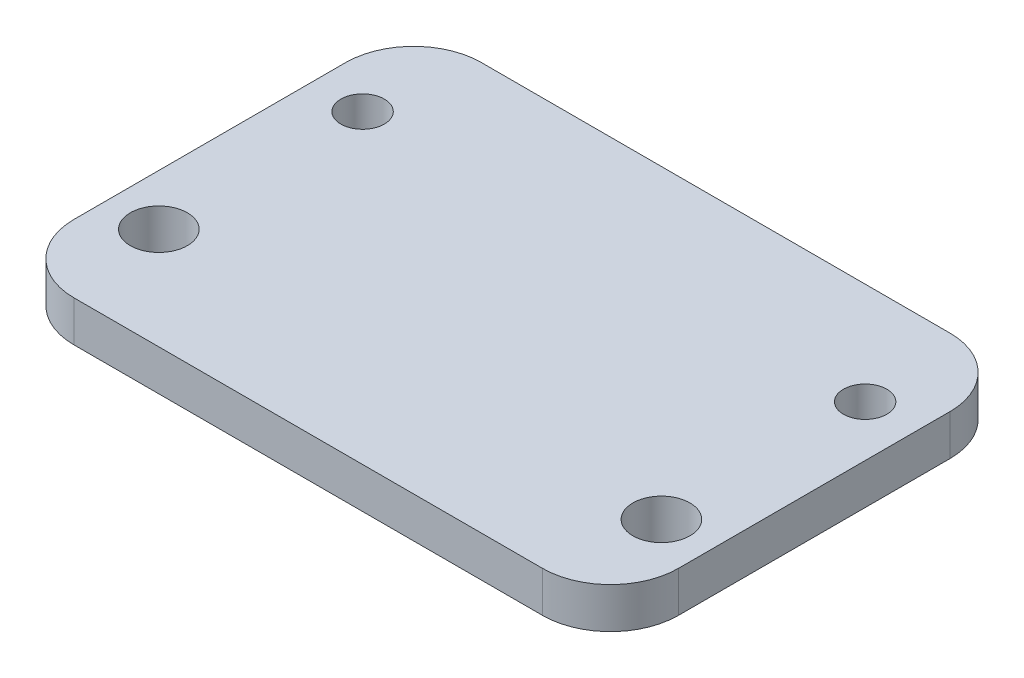
ISO-10303-21;
HEADER;
FILE_DESCRIPTION(('STEP AP214'),'2;1');
FILE_NAME('part.step','',(''),(''),'','','');
FILE_SCHEMA(('AUTOMOTIVE_DESIGN { 1 0 10303 214 1 1 1 1 }'));
ENDSEC;
DATA;
#1=APPLICATION_CONTEXT('core data for automotive mechanical design processes');
#2=APPLICATION_PROTOCOL_DEFINITION('international standard','automotive_design',2000,#1);
#3=PRODUCT_CONTEXT('',#1,'mechanical');
#4=PRODUCT('Part','Part','',(#3));
#5=PRODUCT_RELATED_PRODUCT_CATEGORY('part','',(#4));
#6=PRODUCT_DEFINITION_FORMATION('','',#4);
#7=PRODUCT_DEFINITION_CONTEXT('part definition',#1,'design');
#8=PRODUCT_DEFINITION('design','',#6,#7);
#9=PRODUCT_DEFINITION_SHAPE('','',#8);
#10=(LENGTH_UNIT() NAMED_UNIT(*) SI_UNIT(.MILLI.,.METRE.));
#11=(NAMED_UNIT(*) PLANE_ANGLE_UNIT() SI_UNIT($,.RADIAN.));
#12=(NAMED_UNIT(*) SI_UNIT($,.STERADIAN.) SOLID_ANGLE_UNIT());
#13=UNCERTAINTY_MEASURE_WITH_UNIT(LENGTH_MEASURE(1.E-05),#10,'distance_accuracy_value','');
#14=(GEOMETRIC_REPRESENTATION_CONTEXT(3) GLOBAL_UNCERTAINTY_ASSIGNED_CONTEXT((#13)) GLOBAL_UNIT_ASSIGNED_CONTEXT((#10,
#11,#12)) REPRESENTATION_CONTEXT('',''));
#15=CARTESIAN_POINT('',(0.,0.,0.));
#16=DIRECTION('',(0.,0.,1.));
#17=DIRECTION('',(1.,0.,0.));
#18=AXIS2_PLACEMENT_3D('',#15,#16,#17);
#19=CARTESIAN_POINT('',(0.,3.,0.));
#20=DIRECTION('',(1.,0.,0.));
#21=DIRECTION('',(0.,0.,-1.));
#22=AXIS2_PLACEMENT_3D('',#19,#20,#21);
#23=PLANE('',#22);
#24=DIRECTION('',(0.,0.,1.));
#25=VECTOR('',#24,1.);
#26=CARTESIAN_POINT('',(0.,0.,0.));
#27=LINE('',#26,#25);
#28=CARTESIAN_POINT('',(0.,0.,-25.));
#29=VERTEX_POINT('',#28);
#30=CARTESIAN_POINT('',(0.,0.,-5.));
#31=VERTEX_POINT('',#30);
#32=EDGE_CURVE('E169',#29,#31,#27,.T.);
#33=ORIENTED_EDGE('',*,*,#32,.T.);
#34=DIRECTION('',(0.,-1.,0.));
#35=VECTOR('',#34,1.);
#36=CARTESIAN_POINT('',(0.,3.,-5.));
#37=LINE('',#36,#35);
#38=CARTESIAN_POINT('',(0.,3.,-5.));
#39=VERTEX_POINT('',#38);
#40=EDGE_CURVE('E11',#31,#39,#37,.F.);
#41=ORIENTED_EDGE('',*,*,#40,.T.);
#42=DIRECTION('',(0.,0.,1.));
#43=VECTOR('',#42,1.);
#44=CARTESIAN_POINT('',(0.,3.,0.));
#45=LINE('',#44,#43);
#46=CARTESIAN_POINT('',(0.,3.,-25.));
#47=VERTEX_POINT('',#46);
#48=EDGE_CURVE('E137',#47,#39,#45,.T.);
#49=ORIENTED_EDGE('',*,*,#48,.F.);
#50=DIRECTION('',(0.,-1.,0.));
#51=VECTOR('',#50,1.);
#52=CARTESIAN_POINT('',(0.,3.,-25.));
#53=LINE('',#52,#51);
#54=EDGE_CURVE('E53',#47,#29,#53,.T.);
#55=ORIENTED_EDGE('',*,*,#54,.T.);
#56=EDGE_LOOP('',(#33,#41,#49,#55));
#57=FACE_BOUND('',#56,.T.);
#58=ADVANCED_FACE('F45',(#57),#23,.F.);
#59=CARTESIAN_POINT('',(0.,3.,0.));
#60=DIRECTION('',(0.,0.,-1.));
#61=DIRECTION('',(-1.,0.,0.));
#62=AXIS2_PLACEMENT_3D('',#59,#60,#61);
#63=PLANE('',#62);
#64=DIRECTION('',(1.,0.,0.));
#65=VECTOR('',#64,1.);
#66=CARTESIAN_POINT('',(0.,0.,0.));
#67=LINE('',#66,#65);
#68=CARTESIAN_POINT('',(5.,0.,0.));
#69=VERTEX_POINT('',#68);
#70=CARTESIAN_POINT('',(39.5,0.,0.));
#71=VERTEX_POINT('',#70);
#72=EDGE_CURVE('E142',#69,#71,#67,.T.);
#73=ORIENTED_EDGE('',*,*,#72,.T.);
#74=DIRECTION('',(0.,-1.,0.));
#75=VECTOR('',#74,1.);
#76=CARTESIAN_POINT('',(39.5,3.,0.));
#77=LINE('',#76,#75);
#78=CARTESIAN_POINT('',(39.5,3.,0.));
#79=VERTEX_POINT('',#78);
#80=EDGE_CURVE('E60',#71,#79,#77,.F.);
#81=ORIENTED_EDGE('',*,*,#80,.T.);
#82=DIRECTION('',(1.,0.,0.));
#83=VECTOR('',#82,1.);
#84=CARTESIAN_POINT('',(0.,3.,0.));
#85=LINE('',#84,#83);
#86=CARTESIAN_POINT('',(5.,3.,0.));
#87=VERTEX_POINT('',#86);
#88=EDGE_CURVE('E140',#87,#79,#85,.T.);
#89=ORIENTED_EDGE('',*,*,#88,.F.);
#90=DIRECTION('',(0.,-1.,0.));
#91=VECTOR('',#90,1.);
#92=CARTESIAN_POINT('',(5.,3.,0.));
#93=LINE('',#92,#91);
#94=EDGE_CURVE('E161',#87,#69,#93,.T.);
#95=ORIENTED_EDGE('',*,*,#94,.T.);
#96=EDGE_LOOP('',(#73,#81,#89,#95));
#97=FACE_BOUND('',#96,.T.);
#98=ADVANCED_FACE('F221',(#97),#63,.F.);
#99=CARTESIAN_POINT('',(44.5,3.,0.));
#100=DIRECTION('',(-1.,0.,0.));
#101=DIRECTION('',(0.,0.,1.));
#102=AXIS2_PLACEMENT_3D('',#99,#100,#101);
#103=PLANE('',#102);
#104=DIRECTION('',(0.,0.,-1.));
#105=VECTOR('',#104,1.);
#106=CARTESIAN_POINT('',(44.5,0.,0.));
#107=LINE('',#106,#105);
#108=CARTESIAN_POINT('',(44.5,0.,-5.));
#109=VERTEX_POINT('',#108);
#110=CARTESIAN_POINT('',(44.5,0.,-25.));
#111=VERTEX_POINT('',#110);
#112=EDGE_CURVE('E138',#109,#111,#107,.T.);
#113=ORIENTED_EDGE('',*,*,#112,.T.);
#114=DIRECTION('',(0.,-1.,0.));
#115=VECTOR('',#114,1.);
#116=CARTESIAN_POINT('',(44.5,3.,-25.));
#117=LINE('',#116,#115);
#118=CARTESIAN_POINT('',(44.5,3.,-25.));
#119=VERTEX_POINT('',#118);
#120=EDGE_CURVE('E116',#111,#119,#117,.F.);
#121=ORIENTED_EDGE('',*,*,#120,.T.);
#122=DIRECTION('',(0.,0.,-1.));
#123=VECTOR('',#122,1.);
#124=CARTESIAN_POINT('',(44.5,3.,0.));
#125=LINE('',#124,#123);
#126=CARTESIAN_POINT('',(44.5,3.,-5.));
#127=VERTEX_POINT('',#126);
#128=EDGE_CURVE('E181',#127,#119,#125,.T.);
#129=ORIENTED_EDGE('',*,*,#128,.F.);
#130=DIRECTION('',(0.,-1.,0.));
#131=VECTOR('',#130,1.);
#132=CARTESIAN_POINT('',(44.5,3.,-5.));
#133=LINE('',#132,#131);
#134=EDGE_CURVE('E121',#127,#109,#133,.T.);
#135=ORIENTED_EDGE('',*,*,#134,.T.);
#136=EDGE_LOOP('',(#113,#121,#129,#135));
#137=FACE_BOUND('',#136,.T.);
#138=ADVANCED_FACE('F218',(#137),#103,.F.);
#139=CARTESIAN_POINT('',(0.,3.,-30.));
#140=DIRECTION('',(0.,0.,1.));
#141=DIRECTION('',(1.,0.,0.));
#142=AXIS2_PLACEMENT_3D('',#139,#140,#141);
#143=PLANE('',#142);
#144=DIRECTION('',(-1.,0.,0.));
#145=VECTOR('',#144,1.);
#146=CARTESIAN_POINT('',(0.,3.,-30.));
#147=LINE('',#146,#145);
#148=CARTESIAN_POINT('',(39.5,3.,-30.));
#149=VERTEX_POINT('',#148);
#150=CARTESIAN_POINT('',(5.,3.,-30.));
#151=VERTEX_POINT('',#150);
#152=EDGE_CURVE('E131',#149,#151,#147,.T.);
#153=ORIENTED_EDGE('',*,*,#152,.F.);
#154=DIRECTION('',(0.,-1.,0.));
#155=VECTOR('',#154,1.);
#156=CARTESIAN_POINT('',(39.5,3.,-30.));
#157=LINE('',#156,#155);
#158=CARTESIAN_POINT('',(39.5,0.,-30.));
#159=VERTEX_POINT('',#158);
#160=EDGE_CURVE('E115',#149,#159,#157,.T.);
#161=ORIENTED_EDGE('',*,*,#160,.T.);
#162=DIRECTION('',(-1.,0.,0.));
#163=VECTOR('',#162,1.);
#164=CARTESIAN_POINT('',(0.,0.,-30.));
#165=LINE('',#164,#163);
#166=CARTESIAN_POINT('',(5.,0.,-30.));
#167=VERTEX_POINT('',#166);
#168=EDGE_CURVE('E128',#159,#167,#165,.T.);
#169=ORIENTED_EDGE('',*,*,#168,.T.);
#170=DIRECTION('',(0.,-1.,0.));
#171=VECTOR('',#170,1.);
#172=CARTESIAN_POINT('',(5.,3.,-30.));
#173=LINE('',#172,#171);
#174=EDGE_CURVE('E133',#167,#151,#173,.F.);
#175=ORIENTED_EDGE('',*,*,#174,.T.);
#176=EDGE_LOOP('',(#153,#161,#169,#175));
#177=FACE_BOUND('',#176,.T.);
#178=ADVANCED_FACE('F127',(#177),#143,.F.);
#179=CARTESIAN_POINT('',(0.,3.,0.));
#180=DIRECTION('',(0.,-1.,0.));
#181=DIRECTION('',(0.,0.,-1.));
#182=AXIS2_PLACEMENT_3D('',#179,#180,#181);
#183=PLANE('',#182);
#184=CARTESIAN_POINT('',(40.75,3.,-22.5));
#185=DIRECTION('',(0.,1.,0.));
#186=DIRECTION('',(0.,0.,1.));
#187=AXIS2_PLACEMENT_3D('',#184,#185,#186);
#188=CIRCLE('',#187,1.6);
#189=CARTESIAN_POINT('',(40.75,3.,-20.9));
#190=VERTEX_POINT('',#189);
#191=EDGE_CURVE('E186',#190,#190,#188,.T.);
#192=ORIENTED_EDGE('',*,*,#191,.F.);
#193=EDGE_LOOP('',(#192));
#194=FACE_BOUND('',#193,.T.);
#195=CARTESIAN_POINT('',(3.75,3.,-7.5));
#196=DIRECTION('',(0.,1.,0.));
#197=DIRECTION('',(0.,0.,1.));
#198=AXIS2_PLACEMENT_3D('',#195,#196,#197);
#199=CIRCLE('',#198,2.1);
#200=CARTESIAN_POINT('',(3.75,3.,-5.4));
#201=VERTEX_POINT('',#200);
#202=EDGE_CURVE('E191',#201,#201,#199,.T.);
#203=ORIENTED_EDGE('',*,*,#202,.F.);
#204=EDGE_LOOP('',(#203));
#205=FACE_BOUND('',#204,.T.);
#206=CARTESIAN_POINT('',(40.75,3.,-7.5));
#207=DIRECTION('',(0.,1.,0.));
#208=DIRECTION('',(0.,0.,1.));
#209=AXIS2_PLACEMENT_3D('',#206,#207,#208);
#210=CIRCLE('',#209,2.1);
#211=CARTESIAN_POINT('',(40.75,3.,-5.4));
#212=VERTEX_POINT('',#211);
#213=EDGE_CURVE('E192',#212,#212,#210,.T.);
#214=ORIENTED_EDGE('',*,*,#213,.F.);
#215=EDGE_LOOP('',(#214));
#216=FACE_BOUND('',#215,.T.);
#217=CARTESIAN_POINT('',(3.75,3.,-22.5));
#218=DIRECTION('',(0.,1.,0.));
#219=DIRECTION('',(0.,0.,1.));
#220=AXIS2_PLACEMENT_3D('',#217,#218,#219);
#221=CIRCLE('',#220,1.6);
#222=CARTESIAN_POINT('',(3.75,3.,-20.9));
#223=VERTEX_POINT('',#222);
#224=EDGE_CURVE('E177',#223,#223,#221,.T.);
#225=ORIENTED_EDGE('',*,*,#224,.F.);
#226=EDGE_LOOP('',(#225));
#227=FACE_BOUND('',#226,.T.);
#228=ORIENTED_EDGE('',*,*,#128,.T.);
#229=CARTESIAN_POINT('',(39.5,3.,-25.));
#230=DIRECTION('',(0.,-1.,0.));
#231=DIRECTION('',(0.,0.,-1.));
#232=AXIS2_PLACEMENT_3D('',#229,#230,#231);
#233=CIRCLE('',#232,5.);
#234=EDGE_CURVE('E159',#119,#149,#233,.F.);
#235=ORIENTED_EDGE('',*,*,#234,.T.);
#236=ORIENTED_EDGE('',*,*,#152,.T.);
#237=CARTESIAN_POINT('',(5.,3.,-25.));
#238=DIRECTION('',(0.,-1.,0.));
#239=DIRECTION('',(0.,0.,-1.));
#240=AXIS2_PLACEMENT_3D('',#237,#238,#239);
#241=CIRCLE('',#240,5.);
#242=EDGE_CURVE('E154',#151,#47,#241,.F.);
#243=ORIENTED_EDGE('',*,*,#242,.T.);
#244=ORIENTED_EDGE('',*,*,#48,.T.);
#245=CARTESIAN_POINT('',(5.,3.,-5.));
#246=DIRECTION('',(0.,-1.,0.));
#247=DIRECTION('',(0.,0.,-1.));
#248=AXIS2_PLACEMENT_3D('',#245,#246,#247);
#249=CIRCLE('',#248,5.);
#250=EDGE_CURVE('E67',#39,#87,#249,.F.);
#251=ORIENTED_EDGE('',*,*,#250,.T.);
#252=ORIENTED_EDGE('',*,*,#88,.T.);
#253=CARTESIAN_POINT('',(39.5,3.,-5.));
#254=DIRECTION('',(0.,-1.,0.));
#255=DIRECTION('',(0.,0.,-1.));
#256=AXIS2_PLACEMENT_3D('',#253,#254,#255);
#257=CIRCLE('',#256,5.);
#258=EDGE_CURVE('E157',#79,#127,#257,.F.);
#259=ORIENTED_EDGE('',*,*,#258,.T.);
#260=EDGE_LOOP('',(#228,#235,#236,#243,#244,#251,#252,#259));
#261=FACE_BOUND('',#260,.T.);
#262=ADVANCED_FACE('F208',(#194,#205,#216,#227,#261),#183,.F.);
#263=CARTESIAN_POINT('',(0.,0.,0.));
#264=DIRECTION('',(0.,-1.,0.));
#265=DIRECTION('',(0.,0.,-1.));
#266=AXIS2_PLACEMENT_3D('',#263,#264,#265);
#267=PLANE('',#266);
#268=CARTESIAN_POINT('',(40.75,0.,-22.5));
#269=DIRECTION('',(0.,1.,0.));
#270=DIRECTION('',(0.,0.,1.));
#271=AXIS2_PLACEMENT_3D('',#268,#269,#270);
#272=CIRCLE('',#271,1.6);
#273=CARTESIAN_POINT('',(40.75,0.,-20.9));
#274=VERTEX_POINT('',#273);
#275=EDGE_CURVE('E195',#274,#274,#272,.T.);
#276=ORIENTED_EDGE('',*,*,#275,.T.);
#277=EDGE_LOOP('',(#276));
#278=FACE_BOUND('',#277,.T.);
#279=CARTESIAN_POINT('',(3.75,0.,-7.5));
#280=DIRECTION('',(0.,1.,0.));
#281=DIRECTION('',(0.,0.,1.));
#282=AXIS2_PLACEMENT_3D('',#279,#280,#281);
#283=CIRCLE('',#282,2.1);
#284=CARTESIAN_POINT('',(3.75,0.,-5.4));
#285=VERTEX_POINT('',#284);
#286=EDGE_CURVE('E188',#285,#285,#283,.T.);
#287=ORIENTED_EDGE('',*,*,#286,.T.);
#288=EDGE_LOOP('',(#287));
#289=FACE_BOUND('',#288,.T.);
#290=CARTESIAN_POINT('',(40.75,0.,-7.5));
#291=DIRECTION('',(0.,1.,0.));
#292=DIRECTION('',(0.,0.,1.));
#293=AXIS2_PLACEMENT_3D('',#290,#291,#292);
#294=CIRCLE('',#293,2.1);
#295=CARTESIAN_POINT('',(40.75,0.,-5.4));
#296=VERTEX_POINT('',#295);
#297=EDGE_CURVE('E200',#296,#296,#294,.T.);
#298=ORIENTED_EDGE('',*,*,#297,.T.);
#299=EDGE_LOOP('',(#298));
#300=FACE_BOUND('',#299,.T.);
#301=CARTESIAN_POINT('',(3.75,0.,-22.5));
#302=DIRECTION('',(0.,1.,0.));
#303=DIRECTION('',(0.,0.,1.));
#304=AXIS2_PLACEMENT_3D('',#301,#302,#303);
#305=CIRCLE('',#304,1.6);
#306=CARTESIAN_POINT('',(3.75,0.,-20.9));
#307=VERTEX_POINT('',#306);
#308=EDGE_CURVE('E174',#307,#307,#305,.T.);
#309=ORIENTED_EDGE('',*,*,#308,.T.);
#310=EDGE_LOOP('',(#309));
#311=FACE_BOUND('',#310,.T.);
#312=ORIENTED_EDGE('',*,*,#168,.F.);
#313=CARTESIAN_POINT('',(39.5,0.,-25.));
#314=DIRECTION('',(0.,-1.,0.));
#315=DIRECTION('',(0.,0.,-1.));
#316=AXIS2_PLACEMENT_3D('',#313,#314,#315);
#317=CIRCLE('',#316,5.);
#318=EDGE_CURVE('E111',#159,#111,#317,.T.);
#319=ORIENTED_EDGE('',*,*,#318,.T.);
#320=ORIENTED_EDGE('',*,*,#112,.F.);
#321=CARTESIAN_POINT('',(39.5,0.,-5.));
#322=DIRECTION('',(0.,-1.,0.));
#323=DIRECTION('',(0.,0.,-1.));
#324=AXIS2_PLACEMENT_3D('',#321,#322,#323);
#325=CIRCLE('',#324,5.);
#326=EDGE_CURVE('E122',#109,#71,#325,.T.);
#327=ORIENTED_EDGE('',*,*,#326,.T.);
#328=ORIENTED_EDGE('',*,*,#72,.F.);
#329=CARTESIAN_POINT('',(5.,0.,-5.));
#330=DIRECTION('',(0.,-1.,0.));
#331=DIRECTION('',(0.,0.,-1.));
#332=AXIS2_PLACEMENT_3D('',#329,#330,#331);
#333=CIRCLE('',#332,5.);
#334=EDGE_CURVE('E148',#69,#31,#333,.T.);
#335=ORIENTED_EDGE('',*,*,#334,.T.);
#336=ORIENTED_EDGE('',*,*,#32,.F.);
#337=CARTESIAN_POINT('',(5.,0.,-25.));
#338=DIRECTION('',(0.,-1.,0.));
#339=DIRECTION('',(0.,0.,-1.));
#340=AXIS2_PLACEMENT_3D('',#337,#338,#339);
#341=CIRCLE('',#340,5.);
#342=EDGE_CURVE('E132',#29,#167,#341,.T.);
#343=ORIENTED_EDGE('',*,*,#342,.T.);
#344=EDGE_LOOP('',(#312,#319,#320,#327,#328,#335,#336,#343));
#345=FACE_BOUND('',#344,.T.);
#346=ADVANCED_FACE('F135',(#278,#289,#300,#311,#345),#267,.T.);
#347=CARTESIAN_POINT('',(3.75,0.,-22.5));
#348=DIRECTION('',(0.,1.,0.));
#349=DIRECTION('',(0.,0.,1.));
#350=AXIS2_PLACEMENT_3D('',#347,#348,#349);
#351=CYLINDRICAL_SURFACE('',#350,1.6);
#352=ORIENTED_EDGE('',*,*,#308,.F.);
#353=EDGE_LOOP('',(#352));
#354=FACE_BOUND('',#353,.T.);
#355=ORIENTED_EDGE('',*,*,#224,.T.);
#356=EDGE_LOOP('',(#355));
#357=FACE_BOUND('',#356,.T.);
#358=ADVANCED_FACE('F286',(#354,#357),#351,.F.);
#359=CARTESIAN_POINT('',(40.75,0.,-7.5));
#360=DIRECTION('',(0.,1.,0.));
#361=DIRECTION('',(0.,0.,1.));
#362=AXIS2_PLACEMENT_3D('',#359,#360,#361);
#363=CYLINDRICAL_SURFACE('',#362,2.1);
#364=ORIENTED_EDGE('',*,*,#297,.F.);
#365=EDGE_LOOP('',(#364));
#366=FACE_BOUND('',#365,.T.);
#367=ORIENTED_EDGE('',*,*,#213,.T.);
#368=EDGE_LOOP('',(#367));
#369=FACE_BOUND('',#368,.T.);
#370=ADVANCED_FACE('F206',(#366,#369),#363,.F.);
#371=CARTESIAN_POINT('',(3.75,0.,-7.5));
#372=DIRECTION('',(0.,1.,0.));
#373=DIRECTION('',(0.,0.,1.));
#374=AXIS2_PLACEMENT_3D('',#371,#372,#373);
#375=CYLINDRICAL_SURFACE('',#374,2.1);
#376=ORIENTED_EDGE('',*,*,#286,.F.);
#377=EDGE_LOOP('',(#376));
#378=FACE_BOUND('',#377,.T.);
#379=ORIENTED_EDGE('',*,*,#202,.T.);
#380=EDGE_LOOP('',(#379));
#381=FACE_BOUND('',#380,.T.);
#382=ADVANCED_FACE('F269',(#378,#381),#375,.F.);
#383=CARTESIAN_POINT('',(40.75,0.,-22.5));
#384=DIRECTION('',(0.,1.,0.));
#385=DIRECTION('',(0.,0.,1.));
#386=AXIS2_PLACEMENT_3D('',#383,#384,#385);
#387=CYLINDRICAL_SURFACE('',#386,1.6);
#388=ORIENTED_EDGE('',*,*,#275,.F.);
#389=EDGE_LOOP('',(#388));
#390=FACE_BOUND('',#389,.T.);
#391=ORIENTED_EDGE('',*,*,#191,.T.);
#392=EDGE_LOOP('',(#391));
#393=FACE_BOUND('',#392,.T.);
#394=ADVANCED_FACE('F240',(#390,#393),#387,.F.);
#395=CARTESIAN_POINT('',(39.5,3.,-25.));
#396=DIRECTION('',(0.,-1.,0.));
#397=DIRECTION('',(0.,0.,-1.));
#398=AXIS2_PLACEMENT_3D('',#395,#396,#397);
#399=CYLINDRICAL_SURFACE('',#398,5.);
#400=ORIENTED_EDGE('',*,*,#234,.F.);
#401=ORIENTED_EDGE('',*,*,#120,.F.);
#402=ORIENTED_EDGE('',*,*,#318,.F.);
#403=ORIENTED_EDGE('',*,*,#160,.F.);
#404=EDGE_LOOP('',(#400,#401,#402,#403));
#405=FACE_BOUND('',#404,.T.);
#406=ADVANCED_FACE('F114',(#405),#399,.T.);
#407=CARTESIAN_POINT('',(39.5,3.,-5.));
#408=DIRECTION('',(0.,-1.,0.));
#409=DIRECTION('',(0.,0.,-1.));
#410=AXIS2_PLACEMENT_3D('',#407,#408,#409);
#411=CYLINDRICAL_SURFACE('',#410,5.);
#412=ORIENTED_EDGE('',*,*,#258,.F.);
#413=ORIENTED_EDGE('',*,*,#80,.F.);
#414=ORIENTED_EDGE('',*,*,#326,.F.);
#415=ORIENTED_EDGE('',*,*,#134,.F.);
#416=EDGE_LOOP('',(#412,#413,#414,#415));
#417=FACE_BOUND('',#416,.T.);
#418=ADVANCED_FACE('F220',(#417),#411,.T.);
#419=CARTESIAN_POINT('',(5.,3.,-5.));
#420=DIRECTION('',(0.,-1.,0.));
#421=DIRECTION('',(0.,0.,-1.));
#422=AXIS2_PLACEMENT_3D('',#419,#420,#421);
#423=CYLINDRICAL_SURFACE('',#422,5.);
#424=ORIENTED_EDGE('',*,*,#250,.F.);
#425=ORIENTED_EDGE('',*,*,#40,.F.);
#426=ORIENTED_EDGE('',*,*,#334,.F.);
#427=ORIENTED_EDGE('',*,*,#94,.F.);
#428=EDGE_LOOP('',(#424,#425,#426,#427));
#429=FACE_BOUND('',#428,.T.);
#430=ADVANCED_FACE('F224',(#429),#423,.T.);
#431=CARTESIAN_POINT('',(5.,3.,-25.));
#432=DIRECTION('',(0.,-1.,0.));
#433=DIRECTION('',(0.,0.,-1.));
#434=AXIS2_PLACEMENT_3D('',#431,#432,#433);
#435=CYLINDRICAL_SURFACE('',#434,5.);
#436=ORIENTED_EDGE('',*,*,#242,.F.);
#437=ORIENTED_EDGE('',*,*,#174,.F.);
#438=ORIENTED_EDGE('',*,*,#342,.F.);
#439=ORIENTED_EDGE('',*,*,#54,.F.);
#440=EDGE_LOOP('',(#436,#437,#438,#439));
#441=FACE_BOUND('',#440,.T.);
#442=ADVANCED_FACE('F47',(#441),#435,.T.);
#443=CLOSED_SHELL('',(#58,#98,#138,#178,#262,#346,#358,#370,#382,#394,#406,#418,#430,#442));
#444=MANIFOLD_SOLID_BREP('B2',#443);
#445=ADVANCED_BREP_SHAPE_REPRESENTATION('',(#18,#444),#14);
#446=SHAPE_DEFINITION_REPRESENTATION(#9,#445);
ENDSEC;
END-ISO-10303-21;
